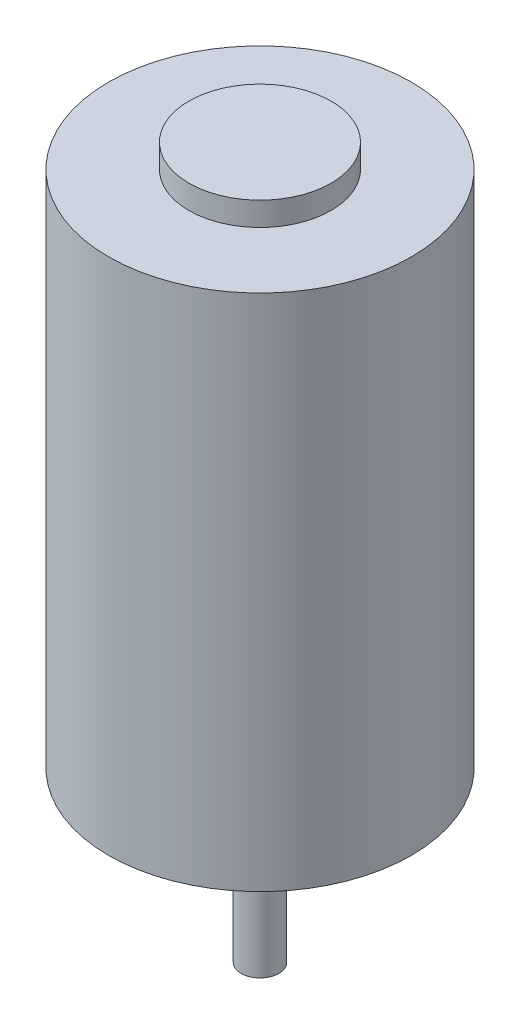
ISO-10303-21;
HEADER;
FILE_DESCRIPTION(('STEP AP214'),'2;1');
FILE_NAME('part.step','',(''),(''),'','','');
FILE_SCHEMA(('AUTOMOTIVE_DESIGN { 1 0 10303 214 1 1 1 1 }'));
ENDSEC;
DATA;
#1=APPLICATION_CONTEXT('core data for automotive mechanical design processes');
#2=APPLICATION_PROTOCOL_DEFINITION('international standard','automotive_design',2000,#1);
#3=PRODUCT_CONTEXT('',#1,'mechanical');
#4=PRODUCT('Part','Part','',(#3));
#5=PRODUCT_RELATED_PRODUCT_CATEGORY('part','',(#4));
#6=PRODUCT_DEFINITION_FORMATION('','',#4);
#7=PRODUCT_DEFINITION_CONTEXT('part definition',#1,'design');
#8=PRODUCT_DEFINITION('design','',#6,#7);
#9=PRODUCT_DEFINITION_SHAPE('','',#8);
#10=(LENGTH_UNIT() NAMED_UNIT(*) SI_UNIT(.MILLI.,.METRE.));
#11=(NAMED_UNIT(*) PLANE_ANGLE_UNIT() SI_UNIT($,.RADIAN.));
#12=(NAMED_UNIT(*) SI_UNIT($,.STERADIAN.) SOLID_ANGLE_UNIT());
#13=UNCERTAINTY_MEASURE_WITH_UNIT(LENGTH_MEASURE(1.E-05),#10,'distance_accuracy_value','');
#14=(GEOMETRIC_REPRESENTATION_CONTEXT(3) GLOBAL_UNCERTAINTY_ASSIGNED_CONTEXT((#13)) GLOBAL_UNIT_ASSIGNED_CONTEXT((#10,
#11,#12)) REPRESENTATION_CONTEXT('',''));
#15=CARTESIAN_POINT('',(0.,0.,0.));
#16=DIRECTION('',(0.,0.,1.));
#17=DIRECTION('',(1.,0.,0.));
#18=AXIS2_PLACEMENT_3D('',#15,#16,#17);
#19=CARTESIAN_POINT('',(0.,114.6048,0.));
#20=DIRECTION('',(0.,-1.,0.));
#21=DIRECTION('',(0.,0.,-1.));
#22=AXIS2_PLACEMENT_3D('',#19,#20,#21);
#23=CYLINDRICAL_SURFACE('',#22,32.004);
#24=CARTESIAN_POINT('',(0.,0.,0.));
#25=DIRECTION('',(0.,1.,0.));
#26=DIRECTION('',(0.,0.,1.));
#27=AXIS2_PLACEMENT_3D('',#24,#25,#26);
#28=CIRCLE('',#27,32.004);
#29=CARTESIAN_POINT('',(0.,0.,32.004));
#30=VERTEX_POINT('',#29);
#31=EDGE_CURVE('E38',#30,#30,#28,.T.);
#32=ORIENTED_EDGE('',*,*,#31,.T.);
#33=EDGE_LOOP('',(#32));
#34=FACE_BOUND('',#33,.T.);
#35=CARTESIAN_POINT('',(0.,109.601,0.));
#36=DIRECTION('',(0.,1.,0.));
#37=DIRECTION('',(0.,0.,1.));
#38=AXIS2_PLACEMENT_3D('',#35,#36,#37);
#39=CIRCLE('',#38,32.004);
#40=CARTESIAN_POINT('',(0.,109.601,32.004));
#41=VERTEX_POINT('',#40);
#42=EDGE_CURVE('E42',#41,#41,#39,.T.);
#43=ORIENTED_EDGE('',*,*,#42,.F.);
#44=EDGE_LOOP('',(#43));
#45=FACE_BOUND('',#44,.T.);
#46=ADVANCED_FACE('F31',(#34,#45),#23,.T.);
#47=CARTESIAN_POINT('',(0.,0.,0.));
#48=DIRECTION('',(0.,1.,0.));
#49=DIRECTION('',(0.,0.,1.));
#50=AXIS2_PLACEMENT_3D('',#47,#48,#49);
#51=PLANE('',#50);
#52=CARTESIAN_POINT('',(0.,0.,0.));
#53=DIRECTION('',(0.,1.,0.));
#54=DIRECTION('',(0.,0.,1.));
#55=AXIS2_PLACEMENT_3D('',#52,#53,#54);
#56=CIRCLE('',#55,9.525);
#57=CARTESIAN_POINT('',(0.,0.,9.525));
#58=VERTEX_POINT('',#57);
#59=EDGE_CURVE('E10',#58,#58,#56,.F.);
#60=ORIENTED_EDGE('',*,*,#59,.F.);
#61=EDGE_LOOP('',(#60));
#62=FACE_BOUND('',#61,.T.);
#63=CARTESIAN_POINT('',(0.,0.,-25.4));
#64=DIRECTION('',(0.,-1.,0.));
#65=DIRECTION('',(0.,0.,1.));
#66=AXIS2_PLACEMENT_3D('',#63,#64,#65);
#67=CIRCLE('',#66,2.0193);
#68=CARTESIAN_POINT('',(0.,0.,-23.3807));
#69=VERTEX_POINT('',#68);
#70=EDGE_CURVE('E60',#69,#69,#67,.T.);
#71=ORIENTED_EDGE('',*,*,#70,.F.);
#72=EDGE_LOOP('',(#71));
#73=FACE_BOUND('',#72,.T.);
#74=CARTESIAN_POINT('',(0.,0.,25.4));
#75=DIRECTION('',(0.,-1.,0.));
#76=DIRECTION('',(0.,0.,-1.));
#77=AXIS2_PLACEMENT_3D('',#74,#75,#76);
#78=CIRCLE('',#77,2.0193);
#79=CARTESIAN_POINT('',(0.,0.,23.3807));
#80=VERTEX_POINT('',#79);
#81=EDGE_CURVE('E54',#80,#80,#78,.T.);
#82=ORIENTED_EDGE('',*,*,#81,.F.);
#83=EDGE_LOOP('',(#82));
#84=FACE_BOUND('',#83,.T.);
#85=ORIENTED_EDGE('',*,*,#31,.F.);
#86=EDGE_LOOP('',(#85));
#87=FACE_BOUND('',#86,.T.);
#88=ADVANCED_FACE('F91',(#62,#73,#84,#87),#51,.F.);
#89=CARTESIAN_POINT('',(0.,109.601,0.));
#90=DIRECTION('',(0.,1.,0.));
#91=DIRECTION('',(0.,0.,1.));
#92=AXIS2_PLACEMENT_3D('',#89,#90,#91);
#93=PLANE('',#92);
#94=CARTESIAN_POINT('',(0.,109.601,0.));
#95=DIRECTION('',(0.,1.,0.));
#96=DIRECTION('',(0.,0.,1.));
#97=AXIS2_PLACEMENT_3D('',#94,#95,#96);
#98=CIRCLE('',#97,15.0368);
#99=CARTESIAN_POINT('',(0.,109.601,15.0368));
#100=VERTEX_POINT('',#99);
#101=EDGE_CURVE('E47',#100,#100,#98,.T.);
#102=ORIENTED_EDGE('',*,*,#101,.F.);
#103=EDGE_LOOP('',(#102));
#104=FACE_BOUND('',#103,.T.);
#105=ORIENTED_EDGE('',*,*,#42,.T.);
#106=EDGE_LOOP('',(#105));
#107=FACE_BOUND('',#106,.T.);
#108=ADVANCED_FACE('F96',(#104,#107),#93,.T.);
#109=CARTESIAN_POINT('',(0.,109.601,0.));
#110=DIRECTION('',(0.,1.,0.));
#111=DIRECTION('',(0.,0.,1.));
#112=AXIS2_PLACEMENT_3D('',#109,#110,#111);
#113=CYLINDRICAL_SURFACE('',#112,15.0368);
#114=ORIENTED_EDGE('',*,*,#101,.T.);
#115=EDGE_LOOP('',(#114));
#116=FACE_BOUND('',#115,.T.);
#117=CARTESIAN_POINT('',(0.,114.6048,0.));
#118=DIRECTION('',(0.,1.,0.));
#119=DIRECTION('',(0.,0.,1.));
#120=AXIS2_PLACEMENT_3D('',#117,#118,#119);
#121=CIRCLE('',#120,15.0368);
#122=CARTESIAN_POINT('',(0.,114.6048,15.0368));
#123=VERTEX_POINT('',#122);
#124=EDGE_CURVE('E48',#123,#123,#121,.T.);
#125=ORIENTED_EDGE('',*,*,#124,.F.);
#126=EDGE_LOOP('',(#125));
#127=FACE_BOUND('',#126,.T.);
#128=ADVANCED_FACE('F103',(#116,#127),#113,.T.);
#129=CARTESIAN_POINT('',(0.,114.6048,0.));
#130=DIRECTION('',(0.,1.,0.));
#131=DIRECTION('',(0.,0.,1.));
#132=AXIS2_PLACEMENT_3D('',#129,#130,#131);
#133=PLANE('',#132);
#134=ORIENTED_EDGE('',*,*,#124,.T.);
#135=EDGE_LOOP('',(#134));
#136=FACE_BOUND('',#135,.T.);
#137=ADVANCED_FACE('F109',(#136),#133,.T.);
#138=CARTESIAN_POINT('',(0.,13.6144,25.4));
#139=DIRECTION('',(0.,-1.,0.));
#140=DIRECTION('',(0.,0.,-1.));
#141=AXIS2_PLACEMENT_3D('',#138,#139,#140);
#142=CYLINDRICAL_SURFACE('',#141,2.0193);
#143=CARTESIAN_POINT('',(0.,13.6144,25.4));
#144=DIRECTION('',(0.,-1.,0.));
#145=DIRECTION('',(0.,0.,-1.));
#146=AXIS2_PLACEMENT_3D('',#143,#144,#145);
#147=CIRCLE('',#146,2.0193);
#148=CARTESIAN_POINT('',(0.,13.6144,23.3807));
#149=VERTEX_POINT('',#148);
#150=EDGE_CURVE('E51',#149,#149,#147,.T.);
#151=ORIENTED_EDGE('',*,*,#150,.F.);
#152=EDGE_LOOP('',(#151));
#153=FACE_BOUND('',#152,.T.);
#154=ORIENTED_EDGE('',*,*,#81,.T.);
#155=EDGE_LOOP('',(#154));
#156=FACE_BOUND('',#155,.T.);
#157=ADVANCED_FACE('F116',(#153,#156),#142,.F.);
#158=CARTESIAN_POINT('',(0.,13.6144,25.4));
#159=DIRECTION('',(0.,-1.,0.));
#160=DIRECTION('',(0.,0.,-1.));
#161=AXIS2_PLACEMENT_3D('',#158,#159,#160);
#162=PLANE('',#161);
#163=ORIENTED_EDGE('',*,*,#150,.T.);
#164=EDGE_LOOP('',(#163));
#165=FACE_BOUND('',#164,.T.);
#166=ADVANCED_FACE('F121',(#165),#162,.T.);
#167=CARTESIAN_POINT('',(0.,13.6144,-25.4));
#168=DIRECTION('',(0.,-1.,0.));
#169=DIRECTION('',(0.,0.,-1.));
#170=AXIS2_PLACEMENT_3D('',#167,#168,#169);
#171=CYLINDRICAL_SURFACE('',#170,2.0193);
#172=CARTESIAN_POINT('',(0.,13.6144,-25.4));
#173=DIRECTION('',(0.,-1.,0.));
#174=DIRECTION('',(0.,0.,1.));
#175=AXIS2_PLACEMENT_3D('',#172,#173,#174);
#176=CIRCLE('',#175,2.0193);
#177=CARTESIAN_POINT('',(0.,13.6144,-23.3807));
#178=VERTEX_POINT('',#177);
#179=EDGE_CURVE('E57',#178,#178,#176,.T.);
#180=ORIENTED_EDGE('',*,*,#179,.F.);
#181=EDGE_LOOP('',(#180));
#182=FACE_BOUND('',#181,.T.);
#183=ORIENTED_EDGE('',*,*,#70,.T.);
#184=EDGE_LOOP('',(#183));
#185=FACE_BOUND('',#184,.T.);
#186=ADVANCED_FACE('F128',(#182,#185),#171,.F.);
#187=CARTESIAN_POINT('',(0.,13.6144,-25.4));
#188=DIRECTION('',(0.,1.,0.));
#189=DIRECTION('',(0.,0.,1.));
#190=AXIS2_PLACEMENT_3D('',#187,#188,#189);
#191=PLANE('',#190);
#192=ORIENTED_EDGE('',*,*,#179,.T.);
#193=EDGE_LOOP('',(#192));
#194=FACE_BOUND('',#193,.T.);
#195=ADVANCED_FACE('F136',(#194),#191,.F.);
#196=CARTESIAN_POINT('',(0.,-3.9878,0.));
#197=DIRECTION('',(0.,1.,0.));
#198=DIRECTION('',(0.,0.,1.));
#199=AXIS2_PLACEMENT_3D('',#196,#197,#198);
#200=CYLINDRICAL_SURFACE('',#199,9.525);
#201=CARTESIAN_POINT('',(0.,-3.9878,0.));
#202=DIRECTION('',(0.,-1.,0.));
#203=DIRECTION('',(0.,0.,-1.));
#204=AXIS2_PLACEMENT_3D('',#201,#202,#203);
#205=CIRCLE('',#204,9.525);
#206=CARTESIAN_POINT('',(0.,-3.9878,-9.525));
#207=VERTEX_POINT('',#206);
#208=EDGE_CURVE('E63',#207,#207,#205,.T.);
#209=ORIENTED_EDGE('',*,*,#208,.F.);
#210=EDGE_LOOP('',(#209));
#211=FACE_BOUND('',#210,.T.);
#212=ORIENTED_EDGE('',*,*,#59,.T.);
#213=EDGE_LOOP('',(#212));
#214=FACE_BOUND('',#213,.T.);
#215=ADVANCED_FACE('F88',(#211,#214),#200,.T.);
#216=CARTESIAN_POINT('',(0.,-3.9878,0.));
#217=DIRECTION('',(0.,-1.,0.));
#218=DIRECTION('',(0.,0.,-1.));
#219=AXIS2_PLACEMENT_3D('',#216,#217,#218);
#220=PLANE('',#219);
#221=CARTESIAN_POINT('',(0.,-3.9878,0.));
#222=DIRECTION('',(0.,-1.,0.));
#223=DIRECTION('',(0.,0.,-1.));
#224=AXIS2_PLACEMENT_3D('',#221,#222,#223);
#225=CIRCLE('',#224,4.0005);
#226=CARTESIAN_POINT('',(0.,-3.9878,-4.0005));
#227=VERTEX_POINT('',#226);
#228=EDGE_CURVE('E34',#227,#227,#225,.F.);
#229=ORIENTED_EDGE('',*,*,#228,.T.);
#230=EDGE_LOOP('',(#229));
#231=FACE_BOUND('',#230,.T.);
#232=ORIENTED_EDGE('',*,*,#208,.T.);
#233=EDGE_LOOP('',(#232));
#234=FACE_BOUND('',#233,.T.);
#235=ADVANCED_FACE('F75',(#231,#234),#220,.T.);
#236=CARTESIAN_POINT('',(0.,-35.6108,0.));
#237=DIRECTION('',(0.,1.,0.));
#238=DIRECTION('',(0.,0.,1.));
#239=AXIS2_PLACEMENT_3D('',#236,#237,#238);
#240=CYLINDRICAL_SURFACE('',#239,4.0005);
#241=ORIENTED_EDGE('',*,*,#228,.F.);
#242=EDGE_LOOP('',(#241));
#243=FACE_BOUND('',#242,.T.);
#244=CARTESIAN_POINT('',(0.,-35.6108,0.));
#245=DIRECTION('',(0.,-1.,0.));
#246=DIRECTION('',(0.,0.,-1.));
#247=AXIS2_PLACEMENT_3D('',#244,#245,#246);
#248=CIRCLE('',#247,4.0005);
#249=CARTESIAN_POINT('',(0.,-35.6108,-4.0005));
#250=VERTEX_POINT('',#249);
#251=EDGE_CURVE('E68',#250,#250,#248,.T.);
#252=ORIENTED_EDGE('',*,*,#251,.F.);
#253=EDGE_LOOP('',(#252));
#254=FACE_BOUND('',#253,.T.);
#255=ADVANCED_FACE('F78',(#243,#254),#240,.T.);
#256=CARTESIAN_POINT('',(0.,-35.6108,0.));
#257=DIRECTION('',(0.,-1.,0.));
#258=DIRECTION('',(0.,0.,-1.));
#259=AXIS2_PLACEMENT_3D('',#256,#257,#258);
#260=PLANE('',#259);
#261=ORIENTED_EDGE('',*,*,#251,.T.);
#262=EDGE_LOOP('',(#261));
#263=FACE_BOUND('',#262,.T.);
#264=ADVANCED_FACE('F81',(#263),#260,.T.);
#265=CLOSED_SHELL('',(#46,#88,#108,#128,#137,#157,#166,#186,#195,#215,#235,#255,#264));
#266=MANIFOLD_SOLID_BREP('B2',#265);
#267=ADVANCED_BREP_SHAPE_REPRESENTATION('',(#18,#266),#14);
#268=SHAPE_DEFINITION_REPRESENTATION(#9,#267);
ENDSEC;
END-ISO-10303-21;
